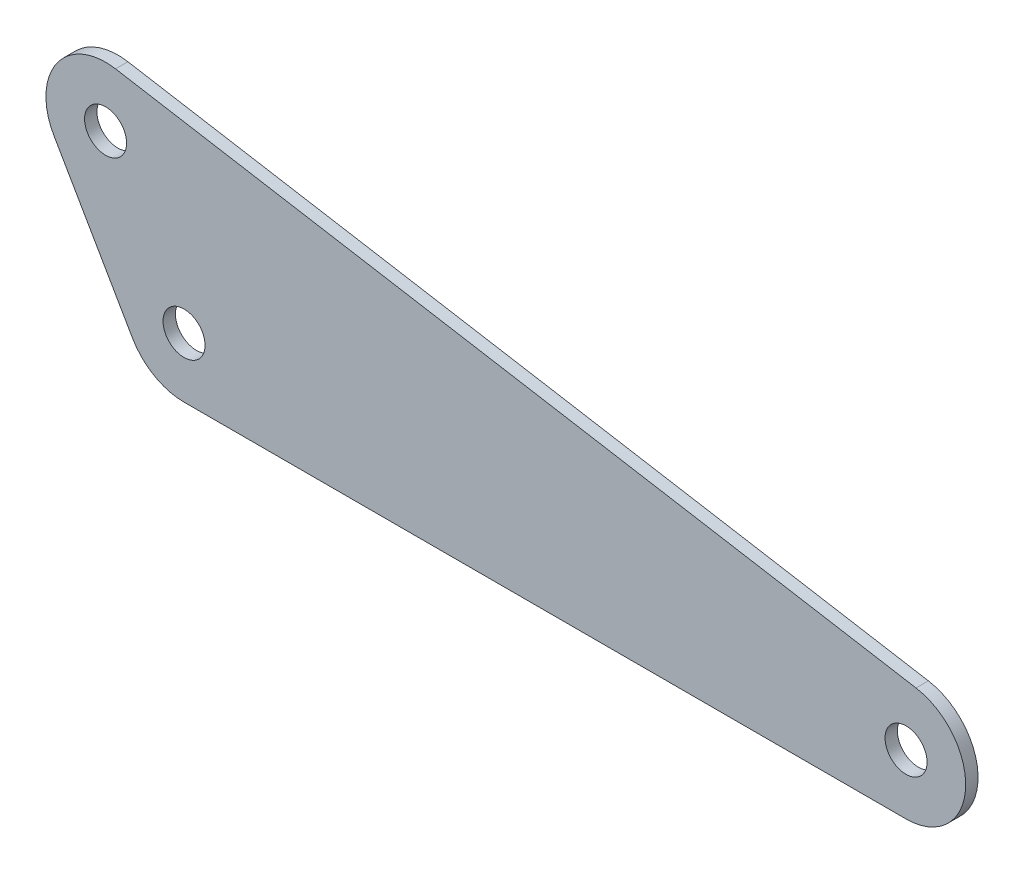
ISO-10303-21;
HEADER;
FILE_DESCRIPTION(('STEP AP214'),'2;1');
FILE_NAME('part.step','',(''),(''),'','','');
FILE_SCHEMA(('AUTOMOTIVE_DESIGN { 1 0 10303 214 1 1 1 1 }'));
ENDSEC;
DATA;
#1=APPLICATION_CONTEXT('core data for automotive mechanical design processes');
#2=APPLICATION_PROTOCOL_DEFINITION('international standard','automotive_design',2000,#1);
#3=PRODUCT_CONTEXT('',#1,'mechanical');
#4=PRODUCT('Part','Part','',(#3));
#5=PRODUCT_RELATED_PRODUCT_CATEGORY('part','',(#4));
#6=PRODUCT_DEFINITION_FORMATION('','',#4);
#7=PRODUCT_DEFINITION_CONTEXT('part definition',#1,'design');
#8=PRODUCT_DEFINITION('design','',#6,#7);
#9=PRODUCT_DEFINITION_SHAPE('','',#8);
#10=(LENGTH_UNIT() NAMED_UNIT(*) SI_UNIT(.MILLI.,.METRE.));
#11=(NAMED_UNIT(*) PLANE_ANGLE_UNIT() SI_UNIT($,.RADIAN.));
#12=(NAMED_UNIT(*) SI_UNIT($,.STERADIAN.) SOLID_ANGLE_UNIT());
#13=UNCERTAINTY_MEASURE_WITH_UNIT(LENGTH_MEASURE(1.E-05),#10,'distance_accuracy_value','');
#14=(GEOMETRIC_REPRESENTATION_CONTEXT(3) GLOBAL_UNCERTAINTY_ASSIGNED_CONTEXT((#13)) GLOBAL_UNIT_ASSIGNED_CONTEXT((#10,
#11,#12)) REPRESENTATION_CONTEXT('',''));
#15=CARTESIAN_POINT('',(0.,0.,0.));
#16=DIRECTION('',(0.,0.,1.));
#17=DIRECTION('',(1.,0.,0.));
#18=AXIS2_PLACEMENT_3D('',#15,#16,#17);
#19=CARTESIAN_POINT('',(-31.7499999999999,54.9926131403119,5.));
#20=DIRECTION('',(0.,0.,1.));
#21=DIRECTION('',(1.,0.,0.));
#22=AXIS2_PLACEMENT_3D('',#19,#20,#21);
#23=PLANE('',#22);
#24=CARTESIAN_POINT('',(292.1,0.,5.));
#25=DIRECTION('',(0.,0.,1.));
#26=DIRECTION('',(1.,0.,0.));
#27=AXIS2_PLACEMENT_3D('',#24,#25,#26);
#28=CIRCLE('',#27,8.50000000000001);
#29=CARTESIAN_POINT('',(300.6,0.,5.));
#30=VERTEX_POINT('',#29);
#31=EDGE_CURVE('E137',#30,#30,#28,.T.);
#32=ORIENTED_EDGE('',*,*,#31,.F.);
#33=EDGE_LOOP('',(#32));
#34=FACE_BOUND('',#33,.T.);
#35=CARTESIAN_POINT('',(-31.7499999999999,54.9926131403119,5.));
#36=DIRECTION('',(0.,0.,1.));
#37=DIRECTION('',(1.,0.,0.));
#38=AXIS2_PLACEMENT_3D('',#35,#36,#37);
#39=CIRCLE('',#38,8.5);
#40=CARTESIAN_POINT('',(-23.2499999999999,54.9926131403119,5.));
#41=VERTEX_POINT('',#40);
#42=EDGE_CURVE('E11',#41,#41,#39,.T.);
#43=ORIENTED_EDGE('',*,*,#42,.F.);
#44=EDGE_LOOP('',(#43));
#45=FACE_BOUND('',#44,.T.);
#46=CARTESIAN_POINT('',(0.,0.,5.));
#47=DIRECTION('',(0.,0.,1.));
#48=DIRECTION('',(1.,0.,0.));
#49=AXIS2_PLACEMENT_3D('',#46,#47,#48);
#50=CIRCLE('',#49,8.5);
#51=CARTESIAN_POINT('',(8.5,0.,5.));
#52=VERTEX_POINT('',#51);
#53=EDGE_CURVE('E143',#52,#52,#50,.T.);
#54=ORIENTED_EDGE('',*,*,#53,.F.);
#55=EDGE_LOOP('',(#54));
#56=FACE_BOUND('',#55,.T.);
#57=DIRECTION('',(1.,0.,0.));
#58=VECTOR('',#57,1.);
#59=CARTESIAN_POINT('',(0.,-24.13,5.));
#60=LINE('',#59,#58);
#61=CARTESIAN_POINT('',(0.,-24.13,5.));
#62=VERTEX_POINT('',#61);
#63=CARTESIAN_POINT('',(292.1,-24.13,5.));
#64=VERTEX_POINT('',#63);
#65=EDGE_CURVE('E126',#62,#64,#60,.T.);
#66=ORIENTED_EDGE('',*,*,#65,.T.);
#67=CARTESIAN_POINT('',(292.1,0.,5.));
#68=DIRECTION('',(0.,0.,1.));
#69=DIRECTION('',(1.,0.,0.));
#70=AXIS2_PLACEMENT_3D('',#67,#68,#69);
#71=CIRCLE('',#70,24.13);
#72=CARTESIAN_POINT('',(296.139660790825,23.7894522991822,5.));
#73=VERTEX_POINT('',#72);
#74=EDGE_CURVE('E115',#64,#73,#71,.T.);
#75=ORIENTED_EDGE('',*,*,#74,.T.);
#76=DIRECTION('',(-0.9858869581095,0.167412382545607,0.));
#77=VECTOR('',#76,1.);
#78=CARTESIAN_POINT('',(296.139660790825,23.7894522991822,5.));
#79=LINE('',#78,#77);
#80=CARTESIAN_POINT('',(-27.7103392091744,78.7820654394942,5.));
#81=VERTEX_POINT('',#80);
#82=EDGE_CURVE('E118',#73,#81,#79,.T.);
#83=ORIENTED_EDGE('',*,*,#82,.T.);
#84=CARTESIAN_POINT('',(-31.7499999999999,54.9926131403119,5.));
#85=DIRECTION('',(0.,0.,1.));
#86=DIRECTION('',(1.,0.,0.));
#87=AXIS2_PLACEMENT_3D('',#84,#85,#86);
#88=CIRCLE('',#87,24.13);
#89=CARTESIAN_POINT('',(-52.6471929933184,42.927613140312,5.));
#90=VERTEX_POINT('',#89);
#91=EDGE_CURVE('E47',#81,#90,#88,.T.);
#92=ORIENTED_EDGE('',*,*,#91,.T.);
#93=DIRECTION('',(0.499999999999998,-0.86602540378444,0.));
#94=VECTOR('',#93,1.);
#95=CARTESIAN_POINT('',(-52.6471929933184,42.927613140312,5.));
#96=LINE('',#95,#94);
#97=CARTESIAN_POINT('',(-20.8971929933185,-12.065,5.));
#98=VERTEX_POINT('',#97);
#99=EDGE_CURVE('E92',#90,#98,#96,.T.);
#100=ORIENTED_EDGE('',*,*,#99,.T.);
#101=CARTESIAN_POINT('',(0.,0.,5.));
#102=DIRECTION('',(0.,0.,1.));
#103=DIRECTION('',(1.,0.,0.));
#104=AXIS2_PLACEMENT_3D('',#101,#102,#103);
#105=CIRCLE('',#104,24.13);
#106=EDGE_CURVE('E123',#98,#62,#105,.T.);
#107=ORIENTED_EDGE('',*,*,#106,.T.);
#108=EDGE_LOOP('',(#66,#75,#83,#92,#100,#107));
#109=FACE_BOUND('',#108,.T.);
#110=ADVANCED_FACE('F32',(#34,#45,#56,#109),#23,.T.);
#111=CARTESIAN_POINT('',(-31.7499999999999,54.9926131403119,0.));
#112=DIRECTION('',(0.,0.,1.));
#113=DIRECTION('',(1.,0.,0.));
#114=AXIS2_PLACEMENT_3D('',#111,#112,#113);
#115=PLANE('',#114);
#116=CARTESIAN_POINT('',(292.1,0.,0.));
#117=DIRECTION('',(0.,0.,1.));
#118=DIRECTION('',(1.,0.,0.));
#119=AXIS2_PLACEMENT_3D('',#116,#117,#118);
#120=CIRCLE('',#119,8.50000000000001);
#121=CARTESIAN_POINT('',(300.6,0.,0.));
#122=VERTEX_POINT('',#121);
#123=EDGE_CURVE('E131',#122,#122,#120,.T.);
#124=ORIENTED_EDGE('',*,*,#123,.T.);
#125=EDGE_LOOP('',(#124));
#126=FACE_BOUND('',#125,.T.);
#127=CARTESIAN_POINT('',(0.,0.,0.));
#128=DIRECTION('',(0.,0.,1.));
#129=DIRECTION('',(1.,0.,0.));
#130=AXIS2_PLACEMENT_3D('',#127,#128,#129);
#131=CIRCLE('',#130,8.5);
#132=CARTESIAN_POINT('',(8.5,0.,0.));
#133=VERTEX_POINT('',#132);
#134=EDGE_CURVE('E140',#133,#133,#131,.T.);
#135=ORIENTED_EDGE('',*,*,#134,.T.);
#136=EDGE_LOOP('',(#135));
#137=FACE_BOUND('',#136,.T.);
#138=CARTESIAN_POINT('',(-31.7499999999999,54.9926131403119,0.));
#139=DIRECTION('',(0.,0.,1.));
#140=DIRECTION('',(1.,0.,0.));
#141=AXIS2_PLACEMENT_3D('',#138,#139,#140);
#142=CIRCLE('',#141,8.5);
#143=CARTESIAN_POINT('',(-23.2499999999999,54.9926131403119,0.));
#144=VERTEX_POINT('',#143);
#145=EDGE_CURVE('E36',#144,#144,#142,.T.);
#146=ORIENTED_EDGE('',*,*,#145,.T.);
#147=EDGE_LOOP('',(#146));
#148=FACE_BOUND('',#147,.T.);
#149=CARTESIAN_POINT('',(292.1,0.,0.));
#150=DIRECTION('',(0.,0.,1.));
#151=DIRECTION('',(1.,0.,0.));
#152=AXIS2_PLACEMENT_3D('',#149,#150,#151);
#153=CIRCLE('',#152,24.13);
#154=CARTESIAN_POINT('',(292.1,-24.13,0.));
#155=VERTEX_POINT('',#154);
#156=CARTESIAN_POINT('',(296.139660790825,23.7894522991822,0.));
#157=VERTEX_POINT('',#156);
#158=EDGE_CURVE('E55',#155,#157,#153,.T.);
#159=ORIENTED_EDGE('',*,*,#158,.F.);
#160=DIRECTION('',(1.,0.,0.));
#161=VECTOR('',#160,1.);
#162=CARTESIAN_POINT('',(0.,-24.13,0.));
#163=LINE('',#162,#161);
#164=CARTESIAN_POINT('',(0.,-24.13,0.));
#165=VERTEX_POINT('',#164);
#166=EDGE_CURVE('E108',#165,#155,#163,.T.);
#167=ORIENTED_EDGE('',*,*,#166,.F.);
#168=CARTESIAN_POINT('',(0.,0.,0.));
#169=DIRECTION('',(0.,0.,1.));
#170=DIRECTION('',(1.,0.,0.));
#171=AXIS2_PLACEMENT_3D('',#168,#169,#170);
#172=CIRCLE('',#171,24.13);
#173=CARTESIAN_POINT('',(-20.8971929933185,-12.065,0.));
#174=VERTEX_POINT('',#173);
#175=EDGE_CURVE('E106',#174,#165,#172,.T.);
#176=ORIENTED_EDGE('',*,*,#175,.F.);
#177=DIRECTION('',(0.499999999999998,-0.86602540378444,0.));
#178=VECTOR('',#177,1.);
#179=CARTESIAN_POINT('',(-52.6471929933184,42.927613140312,0.));
#180=LINE('',#179,#178);
#181=CARTESIAN_POINT('',(-52.6471929933184,42.927613140312,0.));
#182=VERTEX_POINT('',#181);
#183=EDGE_CURVE('E89',#182,#174,#180,.T.);
#184=ORIENTED_EDGE('',*,*,#183,.F.);
#185=CARTESIAN_POINT('',(-31.7499999999999,54.9926131403119,0.));
#186=DIRECTION('',(0.,0.,1.));
#187=DIRECTION('',(1.,0.,0.));
#188=AXIS2_PLACEMENT_3D('',#185,#186,#187);
#189=CIRCLE('',#188,24.13);
#190=CARTESIAN_POINT('',(-27.7103392091744,78.7820654394942,0.));
#191=VERTEX_POINT('',#190);
#192=EDGE_CURVE('E97',#191,#182,#189,.T.);
#193=ORIENTED_EDGE('',*,*,#192,.F.);
#194=DIRECTION('',(-0.9858869581095,0.167412382545607,0.));
#195=VECTOR('',#194,1.);
#196=CARTESIAN_POINT('',(296.139660790825,23.7894522991822,0.));
#197=LINE('',#196,#195);
#198=EDGE_CURVE('E102',#157,#191,#197,.T.);
#199=ORIENTED_EDGE('',*,*,#198,.F.);
#200=EDGE_LOOP('',(#159,#167,#176,#184,#193,#199));
#201=FACE_BOUND('',#200,.T.);
#202=ADVANCED_FACE('F34',(#126,#137,#148,#201),#115,.F.);
#203=CARTESIAN_POINT('',(-31.7499999999999,54.9926131403119,5.));
#204=DIRECTION('',(0.,0.,-1.));
#205=DIRECTION('',(-1.,0.,0.));
#206=AXIS2_PLACEMENT_3D('',#203,#204,#205);
#207=CYLINDRICAL_SURFACE('',#206,8.5);
#208=ORIENTED_EDGE('',*,*,#42,.T.);
#209=EDGE_LOOP('',(#208));
#210=FACE_BOUND('',#209,.T.);
#211=ORIENTED_EDGE('',*,*,#145,.F.);
#212=EDGE_LOOP('',(#211));
#213=FACE_BOUND('',#212,.T.);
#214=ADVANCED_FACE('F154',(#210,#213),#207,.F.);
#215=CARTESIAN_POINT('',(0.,0.,5.));
#216=DIRECTION('',(0.,0.,-1.));
#217=DIRECTION('',(-1.,0.,0.));
#218=AXIS2_PLACEMENT_3D('',#215,#216,#217);
#219=CYLINDRICAL_SURFACE('',#218,8.5);
#220=ORIENTED_EDGE('',*,*,#53,.T.);
#221=EDGE_LOOP('',(#220));
#222=FACE_BOUND('',#221,.T.);
#223=ORIENTED_EDGE('',*,*,#134,.F.);
#224=EDGE_LOOP('',(#223));
#225=FACE_BOUND('',#224,.T.);
#226=ADVANCED_FACE('F151',(#222,#225),#219,.F.);
#227=CARTESIAN_POINT('',(292.1,0.,5.));
#228=DIRECTION('',(0.,0.,-1.));
#229=DIRECTION('',(-1.,0.,0.));
#230=AXIS2_PLACEMENT_3D('',#227,#228,#229);
#231=CYLINDRICAL_SURFACE('',#230,8.50000000000001);
#232=ORIENTED_EDGE('',*,*,#31,.T.);
#233=EDGE_LOOP('',(#232));
#234=FACE_BOUND('',#233,.T.);
#235=ORIENTED_EDGE('',*,*,#123,.F.);
#236=EDGE_LOOP('',(#235));
#237=FACE_BOUND('',#236,.T.);
#238=ADVANCED_FACE('F153',(#234,#237),#231,.F.);
#239=CARTESIAN_POINT('',(292.1,0.,0.));
#240=DIRECTION('',(0.,0.,1.));
#241=DIRECTION('',(1.,0.,0.));
#242=AXIS2_PLACEMENT_3D('',#239,#240,#241);
#243=CYLINDRICAL_SURFACE('',#242,24.13);
#244=ORIENTED_EDGE('',*,*,#74,.F.);
#245=DIRECTION('',(0.,0.,1.));
#246=VECTOR('',#245,1.);
#247=CARTESIAN_POINT('',(292.1,-24.13,0.));
#248=LINE('',#247,#246);
#249=EDGE_CURVE('E129',#155,#64,#248,.T.);
#250=ORIENTED_EDGE('',*,*,#249,.F.);
#251=ORIENTED_EDGE('',*,*,#158,.T.);
#252=DIRECTION('',(0.,0.,1.));
#253=VECTOR('',#252,1.);
#254=CARTESIAN_POINT('',(296.139660790825,23.7894522991822,0.));
#255=LINE('',#254,#253);
#256=EDGE_CURVE('E114',#157,#73,#255,.T.);
#257=ORIENTED_EDGE('',*,*,#256,.T.);
#258=EDGE_LOOP('',(#244,#250,#251,#257));
#259=FACE_BOUND('',#258,.T.);
#260=ADVANCED_FACE('F161',(#259),#243,.T.);
#261=CARTESIAN_POINT('',(0.,-24.13,0.));
#262=DIRECTION('',(0.,-1.,0.));
#263=DIRECTION('',(1.,0.,0.));
#264=AXIS2_PLACEMENT_3D('',#261,#262,#263);
#265=PLANE('',#264);
#266=ORIENTED_EDGE('',*,*,#65,.F.);
#267=DIRECTION('',(0.,0.,1.));
#268=VECTOR('',#267,1.);
#269=CARTESIAN_POINT('',(0.,-24.13,0.));
#270=LINE('',#269,#268);
#271=EDGE_CURVE('E132',#165,#62,#270,.T.);
#272=ORIENTED_EDGE('',*,*,#271,.F.);
#273=ORIENTED_EDGE('',*,*,#166,.T.);
#274=ORIENTED_EDGE('',*,*,#249,.T.);
#275=EDGE_LOOP('',(#266,#272,#273,#274));
#276=FACE_BOUND('',#275,.T.);
#277=ADVANCED_FACE('F182',(#276),#265,.T.);
#278=CARTESIAN_POINT('',(0.,0.,0.));
#279=DIRECTION('',(0.,0.,1.));
#280=DIRECTION('',(1.,0.,0.));
#281=AXIS2_PLACEMENT_3D('',#278,#279,#280);
#282=CYLINDRICAL_SURFACE('',#281,24.13);
#283=ORIENTED_EDGE('',*,*,#106,.F.);
#284=DIRECTION('',(0.,0.,1.));
#285=VECTOR('',#284,1.);
#286=CARTESIAN_POINT('',(-20.8971929933185,-12.065,0.));
#287=LINE('',#286,#285);
#288=EDGE_CURVE('E93',#174,#98,#287,.T.);
#289=ORIENTED_EDGE('',*,*,#288,.F.);
#290=ORIENTED_EDGE('',*,*,#175,.T.);
#291=ORIENTED_EDGE('',*,*,#271,.T.);
#292=EDGE_LOOP('',(#283,#289,#290,#291));
#293=FACE_BOUND('',#292,.T.);
#294=ADVANCED_FACE('F199',(#293),#282,.T.);
#295=CARTESIAN_POINT('',(-52.6471929933184,42.927613140312,0.));
#296=DIRECTION('',(-0.86602540378444,-0.499999999999998,0.));
#297=DIRECTION('',(0.499999999999998,-0.86602540378444,0.));
#298=AXIS2_PLACEMENT_3D('',#295,#296,#297);
#299=PLANE('',#298);
#300=ORIENTED_EDGE('',*,*,#99,.F.);
#301=DIRECTION('',(0.,0.,1.));
#302=VECTOR('',#301,1.);
#303=CARTESIAN_POINT('',(-52.6471929933184,42.927613140312,0.));
#304=LINE('',#303,#302);
#305=EDGE_CURVE('E85',#182,#90,#304,.T.);
#306=ORIENTED_EDGE('',*,*,#305,.F.);
#307=ORIENTED_EDGE('',*,*,#183,.T.);
#308=ORIENTED_EDGE('',*,*,#288,.T.);
#309=EDGE_LOOP('',(#300,#306,#307,#308));
#310=FACE_BOUND('',#309,.T.);
#311=ADVANCED_FACE('F87',(#310),#299,.T.);
#312=CARTESIAN_POINT('',(-31.7499999999999,54.9926131403119,0.));
#313=DIRECTION('',(0.,0.,1.));
#314=DIRECTION('',(1.,0.,0.));
#315=AXIS2_PLACEMENT_3D('',#312,#313,#314);
#316=CYLINDRICAL_SURFACE('',#315,24.13);
#317=ORIENTED_EDGE('',*,*,#91,.F.);
#318=DIRECTION('',(0.,0.,1.));
#319=VECTOR('',#318,1.);
#320=CARTESIAN_POINT('',(-27.7103392091744,78.7820654394942,0.));
#321=LINE('',#320,#319);
#322=EDGE_CURVE('E94',#191,#81,#321,.T.);
#323=ORIENTED_EDGE('',*,*,#322,.F.);
#324=ORIENTED_EDGE('',*,*,#192,.T.);
#325=ORIENTED_EDGE('',*,*,#305,.T.);
#326=EDGE_LOOP('',(#317,#323,#324,#325));
#327=FACE_BOUND('',#326,.T.);
#328=ADVANCED_FACE('F98',(#327),#316,.T.);
#329=CARTESIAN_POINT('',(296.139660790825,23.7894522991822,0.));
#330=DIRECTION('',(0.167412382545607,0.9858869581095,0.));
#331=DIRECTION('',(-0.9858869581095,0.167412382545607,0.));
#332=AXIS2_PLACEMENT_3D('',#329,#330,#331);
#333=PLANE('',#332);
#334=ORIENTED_EDGE('',*,*,#82,.F.);
#335=ORIENTED_EDGE('',*,*,#256,.F.);
#336=ORIENTED_EDGE('',*,*,#198,.T.);
#337=ORIENTED_EDGE('',*,*,#322,.T.);
#338=EDGE_LOOP('',(#334,#335,#336,#337));
#339=FACE_BOUND('',#338,.T.);
#340=ADVANCED_FACE('F185',(#339),#333,.T.);
#341=CLOSED_SHELL('',(#110,#202,#214,#226,#238,#260,#277,#294,#311,#328,#340));
#342=MANIFOLD_SOLID_BREP('B2',#341);
#343=ADVANCED_BREP_SHAPE_REPRESENTATION('',(#18,#342),#14);
#344=SHAPE_DEFINITION_REPRESENTATION(#9,#343);
ENDSEC;
END-ISO-10303-21;
